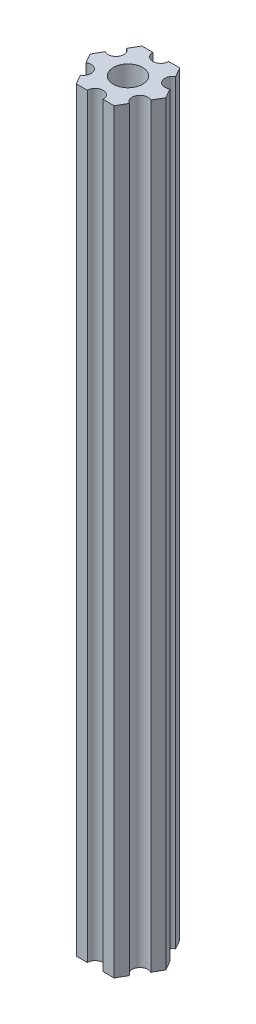
ISO-10303-21;
HEADER;
FILE_DESCRIPTION(('STEP AP214'),'2;1');
FILE_NAME('part.step','',(''),(''),'','','');
FILE_SCHEMA(('AUTOMOTIVE_DESIGN { 1 0 10303 214 1 1 1 1 }'));
ENDSEC;
DATA;
#1=APPLICATION_CONTEXT('core data for automotive mechanical design processes');
#2=APPLICATION_PROTOCOL_DEFINITION('international standard','automotive_design',2000,#1);
#3=PRODUCT_CONTEXT('',#1,'mechanical');
#4=PRODUCT('Part','Part','',(#3));
#5=PRODUCT_RELATED_PRODUCT_CATEGORY('part','',(#4));
#6=PRODUCT_DEFINITION_FORMATION('','',#4);
#7=PRODUCT_DEFINITION_CONTEXT('part definition',#1,'design');
#8=PRODUCT_DEFINITION('design','',#6,#7);
#9=PRODUCT_DEFINITION_SHAPE('','',#8);
#10=(LENGTH_UNIT() NAMED_UNIT(*) SI_UNIT(.MILLI.,.METRE.));
#11=(NAMED_UNIT(*) PLANE_ANGLE_UNIT() SI_UNIT($,.RADIAN.));
#12=(NAMED_UNIT(*) SI_UNIT($,.STERADIAN.) SOLID_ANGLE_UNIT());
#13=UNCERTAINTY_MEASURE_WITH_UNIT(LENGTH_MEASURE(1.E-05),#10,'distance_accuracy_value','');
#14=(GEOMETRIC_REPRESENTATION_CONTEXT(3) GLOBAL_UNCERTAINTY_ASSIGNED_CONTEXT((#13)) GLOBAL_UNIT_ASSIGNED_CONTEXT((#10,
#11,#12)) REPRESENTATION_CONTEXT('',''));
#15=CARTESIAN_POINT('',(0.,0.,0.));
#16=DIRECTION('',(0.,0.,1.));
#17=DIRECTION('',(1.,0.,0.));
#18=AXIS2_PLACEMENT_3D('',#15,#16,#17);
#19=CARTESIAN_POINT('',(5.41265877365274,-59.,3.125));
#20=DIRECTION('',(0.,1.,0.));
#21=DIRECTION('',(0.,0.,1.));
#22=AXIS2_PLACEMENT_3D('',#19,#20,#21);
#23=CYLINDRICAL_SURFACE('',#22,1.5);
#24=CARTESIAN_POINT('',(5.41265877365274,85.,3.125));
#25=DIRECTION('',(0.,-1.,0.));
#26=DIRECTION('',(0.,0.,-1.));
#27=AXIS2_PLACEMENT_3D('',#24,#25,#26);
#28=CIRCLE('',#27,1.5);
#29=CARTESIAN_POINT('',(4.66265877365274,85.,4.42403810567666));
#30=VERTEX_POINT('',#29);
#31=CARTESIAN_POINT('',(6.16265877365274,85.,1.82596189432335));
#32=VERTEX_POINT('',#31);
#33=EDGE_CURVE('E192',#30,#32,#28,.T.);
#34=ORIENTED_EDGE('',*,*,#33,.F.);
#35=DIRECTION('',(0.,1.,0.));
#36=VECTOR('',#35,1.);
#37=CARTESIAN_POINT('',(4.66265877365274,-59.,4.42403810567666));
#38=LINE('',#37,#36);
#39=CARTESIAN_POINT('',(4.66265877365274,-59.,4.42403810567666));
#40=VERTEX_POINT('',#39);
#41=EDGE_CURVE('E11',#40,#30,#38,.T.);
#42=ORIENTED_EDGE('',*,*,#41,.F.);
#43=CARTESIAN_POINT('',(5.41265877365274,-59.,3.125));
#44=DIRECTION('',(0.,-1.,0.));
#45=DIRECTION('',(0.,0.,-1.));
#46=AXIS2_PLACEMENT_3D('',#43,#44,#45);
#47=CIRCLE('',#46,1.5);
#48=CARTESIAN_POINT('',(6.16265877365274,-59.,1.82596189432335));
#49=VERTEX_POINT('',#48);
#50=EDGE_CURVE('E243',#40,#49,#47,.T.);
#51=ORIENTED_EDGE('',*,*,#50,.T.);
#52=DIRECTION('',(0.,1.,0.));
#53=VECTOR('',#52,1.);
#54=CARTESIAN_POINT('',(6.16265877365274,-59.,1.82596189432335));
#55=LINE('',#54,#53);
#56=EDGE_CURVE('E38',#49,#32,#55,.T.);
#57=ORIENTED_EDGE('',*,*,#56,.T.);
#58=EDGE_LOOP('',(#34,#42,#51,#57));
#59=FACE_BOUND('',#58,.T.);
#60=ADVANCED_FACE('F35',(#59),#23,.F.);
#61=CARTESIAN_POINT('',(3.60843918243516,-59.,6.25));
#62=DIRECTION('',(0.866025403784439,0.,0.5));
#63=DIRECTION('',(0.5,0.,-0.866025403784439));
#64=AXIS2_PLACEMENT_3D('',#61,#62,#63);
#65=PLANE('',#64);
#66=DIRECTION('',(0.5,0.,-0.866025403784439));
#67=VECTOR('',#66,1.);
#68=CARTESIAN_POINT('',(3.60843918243516,85.,6.25));
#69=LINE('',#68,#67);
#70=CARTESIAN_POINT('',(3.60843918243516,85.,6.25));
#71=VERTEX_POINT('',#70);
#72=EDGE_CURVE('E241',#71,#30,#69,.T.);
#73=ORIENTED_EDGE('',*,*,#72,.F.);
#74=DIRECTION('',(0.,1.,0.));
#75=VECTOR('',#74,1.);
#76=CARTESIAN_POINT('',(3.60843918243516,-59.,6.25));
#77=LINE('',#76,#75);
#78=CARTESIAN_POINT('',(3.60843918243516,-59.,6.25));
#79=VERTEX_POINT('',#78);
#80=EDGE_CURVE('E44',#79,#71,#77,.T.);
#81=ORIENTED_EDGE('',*,*,#80,.F.);
#82=DIRECTION('',(0.5,0.,-0.866025403784439));
#83=VECTOR('',#82,1.);
#84=CARTESIAN_POINT('',(3.60843918243516,-59.,6.25));
#85=LINE('',#84,#83);
#86=EDGE_CURVE('E182',#79,#40,#85,.T.);
#87=ORIENTED_EDGE('',*,*,#86,.T.);
#88=ORIENTED_EDGE('',*,*,#41,.T.);
#89=EDGE_LOOP('',(#73,#81,#87,#88));
#90=FACE_BOUND('',#89,.T.);
#91=ADVANCED_FACE('F275',(#90),#65,.T.);
#92=CARTESIAN_POINT('',(1.5,-59.,6.25));
#93=DIRECTION('',(0.,0.,1.));
#94=DIRECTION('',(1.,0.,0.));
#95=AXIS2_PLACEMENT_3D('',#92,#93,#94);
#96=PLANE('',#95);
#97=DIRECTION('',(1.,0.,0.));
#98=VECTOR('',#97,1.);
#99=CARTESIAN_POINT('',(1.5,85.,6.25));
#100=LINE('',#99,#98);
#101=CARTESIAN_POINT('',(1.5,85.,6.25));
#102=VERTEX_POINT('',#101);
#103=EDGE_CURVE('E169',#102,#71,#100,.T.);
#104=ORIENTED_EDGE('',*,*,#103,.F.);
#105=DIRECTION('',(0.,1.,0.));
#106=VECTOR('',#105,1.);
#107=CARTESIAN_POINT('',(1.5,-59.,6.25));
#108=LINE('',#107,#106);
#109=CARTESIAN_POINT('',(1.5,-59.,6.25));
#110=VERTEX_POINT('',#109);
#111=EDGE_CURVE('E164',#110,#102,#108,.T.);
#112=ORIENTED_EDGE('',*,*,#111,.F.);
#113=DIRECTION('',(1.,0.,0.));
#114=VECTOR('',#113,1.);
#115=CARTESIAN_POINT('',(1.5,-59.,6.25));
#116=LINE('',#115,#114);
#117=EDGE_CURVE('E167',#110,#79,#116,.T.);
#118=ORIENTED_EDGE('',*,*,#117,.T.);
#119=ORIENTED_EDGE('',*,*,#80,.T.);
#120=EDGE_LOOP('',(#104,#112,#118,#119));
#121=FACE_BOUND('',#120,.T.);
#122=ADVANCED_FACE('F166',(#121),#96,.T.);
#123=CARTESIAN_POINT('',(0.,-59.,6.25));
#124=DIRECTION('',(0.,1.,0.));
#125=DIRECTION('',(0.,0.,1.));
#126=AXIS2_PLACEMENT_3D('',#123,#124,#125);
#127=CYLINDRICAL_SURFACE('',#126,1.5);
#128=CARTESIAN_POINT('',(0.,85.,6.25));
#129=DIRECTION('',(0.,-1.,0.));
#130=DIRECTION('',(0.,0.,-1.));
#131=AXIS2_PLACEMENT_3D('',#128,#129,#130);
#132=CIRCLE('',#131,1.5);
#133=CARTESIAN_POINT('',(-1.5,85.,6.25));
#134=VERTEX_POINT('',#133);
#135=EDGE_CURVE('E238',#134,#102,#132,.T.);
#136=ORIENTED_EDGE('',*,*,#135,.F.);
#137=DIRECTION('',(0.,1.,0.));
#138=VECTOR('',#137,1.);
#139=CARTESIAN_POINT('',(-1.5,-59.,6.25));
#140=LINE('',#139,#138);
#141=CARTESIAN_POINT('',(-1.5,-59.,6.25));
#142=VERTEX_POINT('',#141);
#143=EDGE_CURVE('E174',#142,#134,#140,.T.);
#144=ORIENTED_EDGE('',*,*,#143,.F.);
#145=CARTESIAN_POINT('',(0.,-59.,6.25));
#146=DIRECTION('',(0.,-1.,0.));
#147=DIRECTION('',(0.,0.,-1.));
#148=AXIS2_PLACEMENT_3D('',#145,#146,#147);
#149=CIRCLE('',#148,1.5);
#150=EDGE_CURVE('E180',#142,#110,#149,.T.);
#151=ORIENTED_EDGE('',*,*,#150,.T.);
#152=ORIENTED_EDGE('',*,*,#111,.T.);
#153=EDGE_LOOP('',(#136,#144,#151,#152));
#154=FACE_BOUND('',#153,.T.);
#155=ADVANCED_FACE('F184',(#154),#127,.F.);
#156=CARTESIAN_POINT('',(-3.60843918243516,-59.,6.25));
#157=DIRECTION('',(0.,0.,1.));
#158=DIRECTION('',(1.,0.,0.));
#159=AXIS2_PLACEMENT_3D('',#156,#157,#158);
#160=PLANE('',#159);
#161=DIRECTION('',(1.,0.,0.));
#162=VECTOR('',#161,1.);
#163=CARTESIAN_POINT('',(-3.60843918243516,85.,6.25));
#164=LINE('',#163,#162);
#165=CARTESIAN_POINT('',(-3.60843918243516,85.,6.25));
#166=VERTEX_POINT('',#165);
#167=EDGE_CURVE('E235',#166,#134,#164,.T.);
#168=ORIENTED_EDGE('',*,*,#167,.F.);
#169=DIRECTION('',(0.,1.,0.));
#170=VECTOR('',#169,1.);
#171=CARTESIAN_POINT('',(-3.60843918243516,-59.,6.25));
#172=LINE('',#171,#170);
#173=CARTESIAN_POINT('',(-3.60843918243516,-59.,6.25));
#174=VERTEX_POINT('',#173);
#175=EDGE_CURVE('E247',#174,#166,#172,.T.);
#176=ORIENTED_EDGE('',*,*,#175,.F.);
#177=DIRECTION('',(1.,0.,0.));
#178=VECTOR('',#177,1.);
#179=CARTESIAN_POINT('',(-3.60843918243516,-59.,6.25));
#180=LINE('',#179,#178);
#181=EDGE_CURVE('E185',#174,#142,#180,.T.);
#182=ORIENTED_EDGE('',*,*,#181,.T.);
#183=ORIENTED_EDGE('',*,*,#143,.T.);
#184=EDGE_LOOP('',(#168,#176,#182,#183));
#185=FACE_BOUND('',#184,.T.);
#186=ADVANCED_FACE('F288',(#185),#160,.T.);
#187=CARTESIAN_POINT('',(-4.66265877365274,-59.,4.42403810567666));
#188=DIRECTION('',(-0.866025403784439,0.,0.5));
#189=DIRECTION('',(0.5,0.,0.866025403784439));
#190=AXIS2_PLACEMENT_3D('',#187,#188,#189);
#191=PLANE('',#190);
#192=DIRECTION('',(0.5,0.,0.866025403784439));
#193=VECTOR('',#192,1.);
#194=CARTESIAN_POINT('',(-4.66265877365274,85.,4.42403810567666));
#195=LINE('',#194,#193);
#196=CARTESIAN_POINT('',(-4.66265877365274,85.,4.42403810567666));
#197=VERTEX_POINT('',#196);
#198=EDGE_CURVE('E232',#197,#166,#195,.T.);
#199=ORIENTED_EDGE('',*,*,#198,.F.);
#200=DIRECTION('',(0.,1.,0.));
#201=VECTOR('',#200,1.);
#202=CARTESIAN_POINT('',(-4.66265877365274,-59.,4.42403810567666));
#203=LINE('',#202,#201);
#204=CARTESIAN_POINT('',(-4.66265877365274,-59.,4.42403810567666));
#205=VERTEX_POINT('',#204);
#206=EDGE_CURVE('E249',#205,#197,#203,.T.);
#207=ORIENTED_EDGE('',*,*,#206,.F.);
#208=DIRECTION('',(0.5,0.,0.866025403784439));
#209=VECTOR('',#208,1.);
#210=CARTESIAN_POINT('',(-4.66265877365274,-59.,4.42403810567666));
#211=LINE('',#210,#209);
#212=EDGE_CURVE('E187',#205,#174,#211,.T.);
#213=ORIENTED_EDGE('',*,*,#212,.T.);
#214=ORIENTED_EDGE('',*,*,#175,.T.);
#215=EDGE_LOOP('',(#199,#207,#213,#214));
#216=FACE_BOUND('',#215,.T.);
#217=ADVANCED_FACE('F291',(#216),#191,.T.);
#218=CARTESIAN_POINT('',(-5.41265877365274,-59.,3.125));
#219=DIRECTION('',(0.,1.,0.));
#220=DIRECTION('',(0.,0.,1.));
#221=AXIS2_PLACEMENT_3D('',#218,#219,#220);
#222=CYLINDRICAL_SURFACE('',#221,1.5);
#223=CARTESIAN_POINT('',(-5.41265877365274,85.,3.125));
#224=DIRECTION('',(0.,-1.,0.));
#225=DIRECTION('',(0.,0.,-1.));
#226=AXIS2_PLACEMENT_3D('',#223,#224,#225);
#227=CIRCLE('',#226,1.5);
#228=CARTESIAN_POINT('',(-6.16265877365274,85.,1.82596189432335));
#229=VERTEX_POINT('',#228);
#230=EDGE_CURVE('E229',#229,#197,#227,.T.);
#231=ORIENTED_EDGE('',*,*,#230,.F.);
#232=DIRECTION('',(0.,1.,0.));
#233=VECTOR('',#232,1.);
#234=CARTESIAN_POINT('',(-6.16265877365274,-59.,1.82596189432335));
#235=LINE('',#234,#233);
#236=CARTESIAN_POINT('',(-6.16265877365274,-59.,1.82596189432335));
#237=VERTEX_POINT('',#236);
#238=EDGE_CURVE('E251',#237,#229,#235,.T.);
#239=ORIENTED_EDGE('',*,*,#238,.F.);
#240=CARTESIAN_POINT('',(-5.41265877365274,-59.,3.125));
#241=DIRECTION('',(0.,-1.,0.));
#242=DIRECTION('',(0.,0.,-1.));
#243=AXIS2_PLACEMENT_3D('',#240,#241,#242);
#244=CIRCLE('',#243,1.5);
#245=EDGE_CURVE('E396',#237,#205,#244,.T.);
#246=ORIENTED_EDGE('',*,*,#245,.T.);
#247=ORIENTED_EDGE('',*,*,#206,.T.);
#248=EDGE_LOOP('',(#231,#239,#246,#247));
#249=FACE_BOUND('',#248,.T.);
#250=ADVANCED_FACE('F295',(#249),#222,.F.);
#251=CARTESIAN_POINT('',(-7.21687836487032,-59.,0.));
#252=DIRECTION('',(-0.86602540378444,0.,0.499999999999998));
#253=DIRECTION('',(0.499999999999998,0.,0.86602540378444));
#254=AXIS2_PLACEMENT_3D('',#251,#252,#253);
#255=PLANE('',#254);
#256=DIRECTION('',(0.499999999999998,0.,0.86602540378444));
#257=VECTOR('',#256,1.);
#258=CARTESIAN_POINT('',(-7.21687836487032,85.,0.));
#259=LINE('',#258,#257);
#260=CARTESIAN_POINT('',(-7.21687836487032,85.,0.));
#261=VERTEX_POINT('',#260);
#262=EDGE_CURVE('E226',#261,#229,#259,.T.);
#263=ORIENTED_EDGE('',*,*,#262,.F.);
#264=DIRECTION('',(0.,1.,0.));
#265=VECTOR('',#264,1.);
#266=CARTESIAN_POINT('',(-7.21687836487032,-59.,0.));
#267=LINE('',#266,#265);
#268=CARTESIAN_POINT('',(-7.21687836487032,-59.,0.));
#269=VERTEX_POINT('',#268);
#270=EDGE_CURVE('E253',#269,#261,#267,.T.);
#271=ORIENTED_EDGE('',*,*,#270,.F.);
#272=DIRECTION('',(0.499999999999998,0.,0.86602540378444));
#273=VECTOR('',#272,1.);
#274=CARTESIAN_POINT('',(-7.21687836487032,-59.,0.));
#275=LINE('',#274,#273);
#276=EDGE_CURVE('E393',#269,#237,#275,.T.);
#277=ORIENTED_EDGE('',*,*,#276,.T.);
#278=ORIENTED_EDGE('',*,*,#238,.T.);
#279=EDGE_LOOP('',(#263,#271,#277,#278));
#280=FACE_BOUND('',#279,.T.);
#281=ADVANCED_FACE('F299',(#280),#255,.T.);
#282=CARTESIAN_POINT('',(-6.16265877365274,-59.,-1.82596189432334));
#283=DIRECTION('',(-0.866025403784438,0.,-0.5));
#284=DIRECTION('',(-0.5,0.,0.866025403784439));
#285=AXIS2_PLACEMENT_3D('',#282,#283,#284);
#286=PLANE('',#285);
#287=DIRECTION('',(-0.5,0.,0.866025403784438));
#288=VECTOR('',#287,1.);
#289=CARTESIAN_POINT('',(-6.16265877365274,85.,-1.82596189432334));
#290=LINE('',#289,#288);
#291=CARTESIAN_POINT('',(-6.16265877365274,85.,-1.82596189432334));
#292=VERTEX_POINT('',#291);
#293=EDGE_CURVE('E223',#292,#261,#290,.T.);
#294=ORIENTED_EDGE('',*,*,#293,.F.);
#295=DIRECTION('',(0.,1.,0.));
#296=VECTOR('',#295,1.);
#297=CARTESIAN_POINT('',(-6.16265877365274,-59.,-1.82596189432334));
#298=LINE('',#297,#296);
#299=CARTESIAN_POINT('',(-6.16265877365274,-59.,-1.82596189432334));
#300=VERTEX_POINT('',#299);
#301=EDGE_CURVE('E255',#300,#292,#298,.T.);
#302=ORIENTED_EDGE('',*,*,#301,.F.);
#303=DIRECTION('',(-0.5,0.,0.866025403784438));
#304=VECTOR('',#303,1.);
#305=CARTESIAN_POINT('',(-6.16265877365274,-59.,-1.82596189432334));
#306=LINE('',#305,#304);
#307=EDGE_CURVE('E390',#300,#269,#306,.T.);
#308=ORIENTED_EDGE('',*,*,#307,.T.);
#309=ORIENTED_EDGE('',*,*,#270,.T.);
#310=EDGE_LOOP('',(#294,#302,#308,#309));
#311=FACE_BOUND('',#310,.T.);
#312=ADVANCED_FACE('F303',(#311),#286,.T.);
#313=CARTESIAN_POINT('',(-5.41265877365274,-59.,-3.125));
#314=DIRECTION('',(0.,1.,0.));
#315=DIRECTION('',(0.,0.,1.));
#316=AXIS2_PLACEMENT_3D('',#313,#314,#315);
#317=CYLINDRICAL_SURFACE('',#316,1.5);
#318=CARTESIAN_POINT('',(-5.41265877365274,85.,-3.125));
#319=DIRECTION('',(0.,-1.,0.));
#320=DIRECTION('',(0.,0.,-1.));
#321=AXIS2_PLACEMENT_3D('',#318,#319,#320);
#322=CIRCLE('',#321,1.5);
#323=CARTESIAN_POINT('',(-4.66265877365274,85.,-4.42403810567666));
#324=VERTEX_POINT('',#323);
#325=EDGE_CURVE('E220',#324,#292,#322,.T.);
#326=ORIENTED_EDGE('',*,*,#325,.F.);
#327=DIRECTION('',(0.,1.,0.));
#328=VECTOR('',#327,1.);
#329=CARTESIAN_POINT('',(-4.66265877365274,-59.,-4.42403810567666));
#330=LINE('',#329,#328);
#331=CARTESIAN_POINT('',(-4.66265877365274,-59.,-4.42403810567666));
#332=VERTEX_POINT('',#331);
#333=EDGE_CURVE('E257',#332,#324,#330,.T.);
#334=ORIENTED_EDGE('',*,*,#333,.F.);
#335=CARTESIAN_POINT('',(-5.41265877365274,-59.,-3.125));
#336=DIRECTION('',(0.,-1.,0.));
#337=DIRECTION('',(0.,0.,-1.));
#338=AXIS2_PLACEMENT_3D('',#335,#336,#337);
#339=CIRCLE('',#338,1.5);
#340=EDGE_CURVE('E387',#332,#300,#339,.T.);
#341=ORIENTED_EDGE('',*,*,#340,.T.);
#342=ORIENTED_EDGE('',*,*,#301,.T.);
#343=EDGE_LOOP('',(#326,#334,#341,#342));
#344=FACE_BOUND('',#343,.T.);
#345=ADVANCED_FACE('F307',(#344),#317,.F.);
#346=CARTESIAN_POINT('',(-3.60843918243516,-59.,-6.25));
#347=DIRECTION('',(-0.866025403784439,0.,-0.5));
#348=DIRECTION('',(-0.5,0.,0.866025403784439));
#349=AXIS2_PLACEMENT_3D('',#346,#347,#348);
#350=PLANE('',#349);
#351=DIRECTION('',(-0.5,0.,0.866025403784439));
#352=VECTOR('',#351,1.);
#353=CARTESIAN_POINT('',(-3.60843918243516,85.,-6.25));
#354=LINE('',#353,#352);
#355=CARTESIAN_POINT('',(-3.60843918243516,85.,-6.25));
#356=VERTEX_POINT('',#355);
#357=EDGE_CURVE('E217',#356,#324,#354,.T.);
#358=ORIENTED_EDGE('',*,*,#357,.F.);
#359=DIRECTION('',(0.,1.,0.));
#360=VECTOR('',#359,1.);
#361=CARTESIAN_POINT('',(-3.60843918243516,-59.,-6.25));
#362=LINE('',#361,#360);
#363=CARTESIAN_POINT('',(-3.60843918243516,-59.,-6.25));
#364=VERTEX_POINT('',#363);
#365=EDGE_CURVE('E259',#364,#356,#362,.T.);
#366=ORIENTED_EDGE('',*,*,#365,.F.);
#367=DIRECTION('',(-0.5,0.,0.866025403784439));
#368=VECTOR('',#367,1.);
#369=CARTESIAN_POINT('',(-3.60843918243516,-59.,-6.25));
#370=LINE('',#369,#368);
#371=EDGE_CURVE('E384',#364,#332,#370,.T.);
#372=ORIENTED_EDGE('',*,*,#371,.T.);
#373=ORIENTED_EDGE('',*,*,#333,.T.);
#374=EDGE_LOOP('',(#358,#366,#372,#373));
#375=FACE_BOUND('',#374,.T.);
#376=ADVANCED_FACE('F311',(#375),#350,.T.);
#377=CARTESIAN_POINT('',(-1.5,-59.,-6.25));
#378=DIRECTION('',(0.,0.,-1.));
#379=DIRECTION('',(-1.,0.,0.));
#380=AXIS2_PLACEMENT_3D('',#377,#378,#379);
#381=PLANE('',#380);
#382=DIRECTION('',(-1.,0.,0.));
#383=VECTOR('',#382,1.);
#384=CARTESIAN_POINT('',(-1.5,85.,-6.25));
#385=LINE('',#384,#383);
#386=CARTESIAN_POINT('',(-1.5,85.,-6.25));
#387=VERTEX_POINT('',#386);
#388=EDGE_CURVE('E214',#387,#356,#385,.T.);
#389=ORIENTED_EDGE('',*,*,#388,.F.);
#390=DIRECTION('',(0.,1.,0.));
#391=VECTOR('',#390,1.);
#392=CARTESIAN_POINT('',(-1.5,-59.,-6.25));
#393=LINE('',#392,#391);
#394=CARTESIAN_POINT('',(-1.5,-59.,-6.25));
#395=VERTEX_POINT('',#394);
#396=EDGE_CURVE('E261',#395,#387,#393,.T.);
#397=ORIENTED_EDGE('',*,*,#396,.F.);
#398=DIRECTION('',(-1.,0.,0.));
#399=VECTOR('',#398,1.);
#400=CARTESIAN_POINT('',(-1.5,-59.,-6.25));
#401=LINE('',#400,#399);
#402=EDGE_CURVE('E381',#395,#364,#401,.T.);
#403=ORIENTED_EDGE('',*,*,#402,.T.);
#404=ORIENTED_EDGE('',*,*,#365,.T.);
#405=EDGE_LOOP('',(#389,#397,#403,#404));
#406=FACE_BOUND('',#405,.T.);
#407=ADVANCED_FACE('F315',(#406),#381,.T.);
#408=CARTESIAN_POINT('',(0.,-59.,-6.25));
#409=DIRECTION('',(0.,1.,0.));
#410=DIRECTION('',(0.,0.,1.));
#411=AXIS2_PLACEMENT_3D('',#408,#409,#410);
#412=CYLINDRICAL_SURFACE('',#411,1.5);
#413=CARTESIAN_POINT('',(0.,85.,-6.25));
#414=DIRECTION('',(0.,-1.,0.));
#415=DIRECTION('',(0.,0.,-1.));
#416=AXIS2_PLACEMENT_3D('',#413,#414,#415);
#417=CIRCLE('',#416,1.5);
#418=CARTESIAN_POINT('',(1.5,85.,-6.25));
#419=VERTEX_POINT('',#418);
#420=EDGE_CURVE('E211',#419,#387,#417,.T.);
#421=ORIENTED_EDGE('',*,*,#420,.F.);
#422=DIRECTION('',(0.,1.,0.));
#423=VECTOR('',#422,1.);
#424=CARTESIAN_POINT('',(1.5,-59.,-6.25));
#425=LINE('',#424,#423);
#426=CARTESIAN_POINT('',(1.5,-59.,-6.25));
#427=VERTEX_POINT('',#426);
#428=EDGE_CURVE('E263',#427,#419,#425,.T.);
#429=ORIENTED_EDGE('',*,*,#428,.F.);
#430=CARTESIAN_POINT('',(0.,-59.,-6.25));
#431=DIRECTION('',(0.,-1.,0.));
#432=DIRECTION('',(0.,0.,-1.));
#433=AXIS2_PLACEMENT_3D('',#430,#431,#432);
#434=CIRCLE('',#433,1.5);
#435=EDGE_CURVE('E378',#427,#395,#434,.T.);
#436=ORIENTED_EDGE('',*,*,#435,.T.);
#437=ORIENTED_EDGE('',*,*,#396,.T.);
#438=EDGE_LOOP('',(#421,#429,#436,#437));
#439=FACE_BOUND('',#438,.T.);
#440=ADVANCED_FACE('F319',(#439),#412,.F.);
#441=CARTESIAN_POINT('',(3.60843918243516,-59.,-6.25));
#442=DIRECTION('',(0.,0.,-1.));
#443=DIRECTION('',(-1.,0.,0.));
#444=AXIS2_PLACEMENT_3D('',#441,#442,#443);
#445=PLANE('',#444);
#446=DIRECTION('',(-1.,0.,0.));
#447=VECTOR('',#446,1.);
#448=CARTESIAN_POINT('',(3.60843918243516,85.,-6.25));
#449=LINE('',#448,#447);
#450=CARTESIAN_POINT('',(3.60843918243516,85.,-6.25));
#451=VERTEX_POINT('',#450);
#452=EDGE_CURVE('E208',#451,#419,#449,.T.);
#453=ORIENTED_EDGE('',*,*,#452,.F.);
#454=DIRECTION('',(0.,1.,0.));
#455=VECTOR('',#454,1.);
#456=CARTESIAN_POINT('',(3.60843918243516,-59.,-6.25));
#457=LINE('',#456,#455);
#458=CARTESIAN_POINT('',(3.60843918243516,-59.,-6.25));
#459=VERTEX_POINT('',#458);
#460=EDGE_CURVE('E265',#459,#451,#457,.T.);
#461=ORIENTED_EDGE('',*,*,#460,.F.);
#462=DIRECTION('',(-1.,0.,0.));
#463=VECTOR('',#462,1.);
#464=CARTESIAN_POINT('',(3.60843918243516,-59.,-6.25));
#465=LINE('',#464,#463);
#466=EDGE_CURVE('E375',#459,#427,#465,.T.);
#467=ORIENTED_EDGE('',*,*,#466,.T.);
#468=ORIENTED_EDGE('',*,*,#428,.T.);
#469=EDGE_LOOP('',(#453,#461,#467,#468));
#470=FACE_BOUND('',#469,.T.);
#471=ADVANCED_FACE('F323',(#470),#445,.T.);
#472=CARTESIAN_POINT('',(4.66265877365274,-59.,-4.42403810567666));
#473=DIRECTION('',(0.866025403784439,0.,-0.5));
#474=DIRECTION('',(-0.5,0.,-0.866025403784439));
#475=AXIS2_PLACEMENT_3D('',#472,#473,#474);
#476=PLANE('',#475);
#477=DIRECTION('',(-0.5,0.,-0.866025403784439));
#478=VECTOR('',#477,1.);
#479=CARTESIAN_POINT('',(4.66265877365274,85.,-4.42403810567666));
#480=LINE('',#479,#478);
#481=CARTESIAN_POINT('',(4.66265877365274,85.,-4.42403810567666));
#482=VERTEX_POINT('',#481);
#483=EDGE_CURVE('E205',#482,#451,#480,.T.);
#484=ORIENTED_EDGE('',*,*,#483,.F.);
#485=DIRECTION('',(0.,1.,0.));
#486=VECTOR('',#485,1.);
#487=CARTESIAN_POINT('',(4.66265877365274,-59.,-4.42403810567666));
#488=LINE('',#487,#486);
#489=CARTESIAN_POINT('',(4.66265877365274,-59.,-4.42403810567666));
#490=VERTEX_POINT('',#489);
#491=EDGE_CURVE('E267',#490,#482,#488,.T.);
#492=ORIENTED_EDGE('',*,*,#491,.F.);
#493=DIRECTION('',(-0.5,0.,-0.866025403784439));
#494=VECTOR('',#493,1.);
#495=CARTESIAN_POINT('',(4.66265877365274,-59.,-4.42403810567666));
#496=LINE('',#495,#494);
#497=EDGE_CURVE('E372',#490,#459,#496,.T.);
#498=ORIENTED_EDGE('',*,*,#497,.T.);
#499=ORIENTED_EDGE('',*,*,#460,.T.);
#500=EDGE_LOOP('',(#484,#492,#498,#499));
#501=FACE_BOUND('',#500,.T.);
#502=ADVANCED_FACE('F327',(#501),#476,.T.);
#503=CARTESIAN_POINT('',(5.41265877365274,-59.,-3.125));
#504=DIRECTION('',(0.,1.,0.));
#505=DIRECTION('',(0.,0.,1.));
#506=AXIS2_PLACEMENT_3D('',#503,#504,#505);
#507=CYLINDRICAL_SURFACE('',#506,1.5);
#508=CARTESIAN_POINT('',(5.41265877365274,85.,-3.125));
#509=DIRECTION('',(0.,-1.,0.));
#510=DIRECTION('',(0.,0.,-1.));
#511=AXIS2_PLACEMENT_3D('',#508,#509,#510);
#512=CIRCLE('',#511,1.5);
#513=CARTESIAN_POINT('',(6.16265877365274,85.,-1.82596189432334));
#514=VERTEX_POINT('',#513);
#515=EDGE_CURVE('E202',#514,#482,#512,.T.);
#516=ORIENTED_EDGE('',*,*,#515,.F.);
#517=DIRECTION('',(0.,1.,0.));
#518=VECTOR('',#517,1.);
#519=CARTESIAN_POINT('',(6.16265877365274,-59.,-1.82596189432334));
#520=LINE('',#519,#518);
#521=CARTESIAN_POINT('',(6.16265877365274,-59.,-1.82596189432334));
#522=VERTEX_POINT('',#521);
#523=EDGE_CURVE('E269',#522,#514,#520,.T.);
#524=ORIENTED_EDGE('',*,*,#523,.F.);
#525=CARTESIAN_POINT('',(5.41265877365274,-59.,-3.125));
#526=DIRECTION('',(0.,-1.,0.));
#527=DIRECTION('',(0.,0.,-1.));
#528=AXIS2_PLACEMENT_3D('',#525,#526,#527);
#529=CIRCLE('',#528,1.5);
#530=EDGE_CURVE('E369',#522,#490,#529,.T.);
#531=ORIENTED_EDGE('',*,*,#530,.T.);
#532=ORIENTED_EDGE('',*,*,#491,.T.);
#533=EDGE_LOOP('',(#516,#524,#531,#532));
#534=FACE_BOUND('',#533,.T.);
#535=ADVANCED_FACE('F331',(#534),#507,.F.);
#536=CARTESIAN_POINT('',(7.21687836487032,-59.,0.));
#537=DIRECTION('',(0.866025403784438,0.,-0.5));
#538=DIRECTION('',(-0.5,0.,-0.866025403784439));
#539=AXIS2_PLACEMENT_3D('',#536,#537,#538);
#540=PLANE('',#539);
#541=DIRECTION('',(-0.5,0.,-0.866025403784439));
#542=VECTOR('',#541,1.);
#543=CARTESIAN_POINT('',(7.21687836487032,85.,0.));
#544=LINE('',#543,#542);
#545=CARTESIAN_POINT('',(7.21687836487032,85.,0.));
#546=VERTEX_POINT('',#545);
#547=EDGE_CURVE('E199',#546,#514,#544,.T.);
#548=ORIENTED_EDGE('',*,*,#547,.F.);
#549=DIRECTION('',(0.,1.,0.));
#550=VECTOR('',#549,1.);
#551=CARTESIAN_POINT('',(7.21687836487032,-59.,0.));
#552=LINE('',#551,#550);
#553=CARTESIAN_POINT('',(7.21687836487032,-59.,0.));
#554=VERTEX_POINT('',#553);
#555=EDGE_CURVE('E270',#554,#546,#552,.T.);
#556=ORIENTED_EDGE('',*,*,#555,.F.);
#557=DIRECTION('',(-0.5,0.,-0.866025403784439));
#558=VECTOR('',#557,1.);
#559=CARTESIAN_POINT('',(7.21687836487032,-59.,0.));
#560=LINE('',#559,#558);
#561=EDGE_CURVE('E366',#554,#522,#560,.T.);
#562=ORIENTED_EDGE('',*,*,#561,.T.);
#563=ORIENTED_EDGE('',*,*,#523,.T.);
#564=EDGE_LOOP('',(#548,#556,#562,#563));
#565=FACE_BOUND('',#564,.T.);
#566=ADVANCED_FACE('F335',(#565),#540,.T.);
#567=CARTESIAN_POINT('',(6.16265877365274,-59.,1.82596189432335));
#568=DIRECTION('',(0.866025403784439,0.,0.499999999999999));
#569=DIRECTION('',(0.499999999999999,0.,-0.866025403784439));
#570=AXIS2_PLACEMENT_3D('',#567,#568,#569);
#571=PLANE('',#570);
#572=DIRECTION('',(0.499999999999999,0.,-0.86602540378444));
#573=VECTOR('',#572,1.);
#574=CARTESIAN_POINT('',(6.16265877365274,85.,1.82596189432335));
#575=LINE('',#574,#573);
#576=EDGE_CURVE('E195',#32,#546,#575,.T.);
#577=ORIENTED_EDGE('',*,*,#576,.F.);
#578=ORIENTED_EDGE('',*,*,#56,.F.);
#579=DIRECTION('',(0.499999999999999,0.,-0.86602540378444));
#580=VECTOR('',#579,1.);
#581=CARTESIAN_POINT('',(6.16265877365274,-59.,1.82596189432335));
#582=LINE('',#581,#580);
#583=EDGE_CURVE('E364',#49,#554,#582,.T.);
#584=ORIENTED_EDGE('',*,*,#583,.T.);
#585=ORIENTED_EDGE('',*,*,#555,.T.);
#586=EDGE_LOOP('',(#577,#578,#584,#585));
#587=FACE_BOUND('',#586,.T.);
#588=ADVANCED_FACE('F272',(#587),#571,.T.);
#589=CARTESIAN_POINT('',(5.41265877365274,-59.,3.125));
#590=DIRECTION('',(0.,-1.,0.));
#591=DIRECTION('',(0.,0.,-1.));
#592=AXIS2_PLACEMENT_3D('',#589,#590,#591);
#593=PLANE('',#592);
#594=CARTESIAN_POINT('',(0.,-59.,0.));
#595=DIRECTION('',(0.,1.,0.));
#596=DIRECTION('',(0.,0.,-1.));
#597=AXIS2_PLACEMENT_3D('',#594,#595,#596);
#598=CIRCLE('',#597,2.79);
#599=CARTESIAN_POINT('',(0.,-59.,-2.79));
#600=VERTEX_POINT('',#599);
#601=EDGE_CURVE('E196',#600,#600,#598,.T.);
#602=ORIENTED_EDGE('',*,*,#601,.T.);
#603=EDGE_LOOP('',(#602));
#604=FACE_BOUND('',#603,.T.);
#605=ORIENTED_EDGE('',*,*,#50,.F.);
#606=ORIENTED_EDGE('',*,*,#86,.F.);
#607=ORIENTED_EDGE('',*,*,#117,.F.);
#608=ORIENTED_EDGE('',*,*,#150,.F.);
#609=ORIENTED_EDGE('',*,*,#181,.F.);
#610=ORIENTED_EDGE('',*,*,#212,.F.);
#611=ORIENTED_EDGE('',*,*,#245,.F.);
#612=ORIENTED_EDGE('',*,*,#276,.F.);
#613=ORIENTED_EDGE('',*,*,#307,.F.);
#614=ORIENTED_EDGE('',*,*,#340,.F.);
#615=ORIENTED_EDGE('',*,*,#371,.F.);
#616=ORIENTED_EDGE('',*,*,#402,.F.);
#617=ORIENTED_EDGE('',*,*,#435,.F.);
#618=ORIENTED_EDGE('',*,*,#466,.F.);
#619=ORIENTED_EDGE('',*,*,#497,.F.);
#620=ORIENTED_EDGE('',*,*,#530,.F.);
#621=ORIENTED_EDGE('',*,*,#561,.F.);
#622=ORIENTED_EDGE('',*,*,#583,.F.);
#623=EDGE_LOOP('',(#605,#606,#607,#608,#609,#610,#611,#612,#613,#614,#615,#616,#617,#618,#619,
#620,#621,#622));
#624=FACE_BOUND('',#623,.T.);
#625=ADVANCED_FACE('F178',(#604,#624),#593,.T.);
#626=CARTESIAN_POINT('',(5.41265877365274,85.,3.125));
#627=DIRECTION('',(0.,-1.,0.));
#628=DIRECTION('',(0.,0.,-1.));
#629=AXIS2_PLACEMENT_3D('',#626,#627,#628);
#630=PLANE('',#629);
#631=CARTESIAN_POINT('',(0.,85.,0.));
#632=DIRECTION('',(0.,1.,0.));
#633=DIRECTION('',(0.,0.,-1.));
#634=AXIS2_PLACEMENT_3D('',#631,#632,#633);
#635=CIRCLE('',#634,2.79);
#636=CARTESIAN_POINT('',(0.,85.,-2.79));
#637=VERTEX_POINT('',#636);
#638=EDGE_CURVE('E359',#637,#637,#635,.T.);
#639=ORIENTED_EDGE('',*,*,#638,.F.);
#640=EDGE_LOOP('',(#639));
#641=FACE_BOUND('',#640,.T.);
#642=ORIENTED_EDGE('',*,*,#33,.T.);
#643=ORIENTED_EDGE('',*,*,#576,.T.);
#644=ORIENTED_EDGE('',*,*,#547,.T.);
#645=ORIENTED_EDGE('',*,*,#515,.T.);
#646=ORIENTED_EDGE('',*,*,#483,.T.);
#647=ORIENTED_EDGE('',*,*,#452,.T.);
#648=ORIENTED_EDGE('',*,*,#420,.T.);
#649=ORIENTED_EDGE('',*,*,#388,.T.);
#650=ORIENTED_EDGE('',*,*,#357,.T.);
#651=ORIENTED_EDGE('',*,*,#325,.T.);
#652=ORIENTED_EDGE('',*,*,#293,.T.);
#653=ORIENTED_EDGE('',*,*,#262,.T.);
#654=ORIENTED_EDGE('',*,*,#230,.T.);
#655=ORIENTED_EDGE('',*,*,#198,.T.);
#656=ORIENTED_EDGE('',*,*,#167,.T.);
#657=ORIENTED_EDGE('',*,*,#135,.T.);
#658=ORIENTED_EDGE('',*,*,#103,.T.);
#659=ORIENTED_EDGE('',*,*,#72,.T.);
#660=EDGE_LOOP('',(#642,#643,#644,#645,#646,#647,#648,#649,#650,#651,#652,#653,#654,#655,#656,
#657,#658,#659));
#661=FACE_BOUND('',#660,.T.);
#662=ADVANCED_FACE('F274',(#641,#661),#630,.F.);
#663=CARTESIAN_POINT('',(0.,-59.,0.));
#664=DIRECTION('',(0.,1.,0.));
#665=DIRECTION('',(0.,0.,1.));
#666=AXIS2_PLACEMENT_3D('',#663,#664,#665);
#667=CYLINDRICAL_SURFACE('',#666,2.79);
#668=ORIENTED_EDGE('',*,*,#601,.F.);
#669=EDGE_LOOP('',(#668));
#670=FACE_BOUND('',#669,.T.);
#671=ORIENTED_EDGE('',*,*,#638,.T.);
#672=EDGE_LOOP('',(#671));
#673=FACE_BOUND('',#672,.T.);
#674=ADVANCED_FACE('F347',(#670,#673),#667,.F.);
#675=CLOSED_SHELL('',(#60,#91,#122,#155,#186,#217,#250,#281,#312,#345,#376,#407,#440,#471,#502,
#535,#566,#588,#625,#662,#674));
#676=MANIFOLD_SOLID_BREP('B2',#675);
#677=ADVANCED_BREP_SHAPE_REPRESENTATION('',(#18,#676),#14);
#678=SHAPE_DEFINITION_REPRESENTATION(#9,#677);
ENDSEC;
END-ISO-10303-21;
